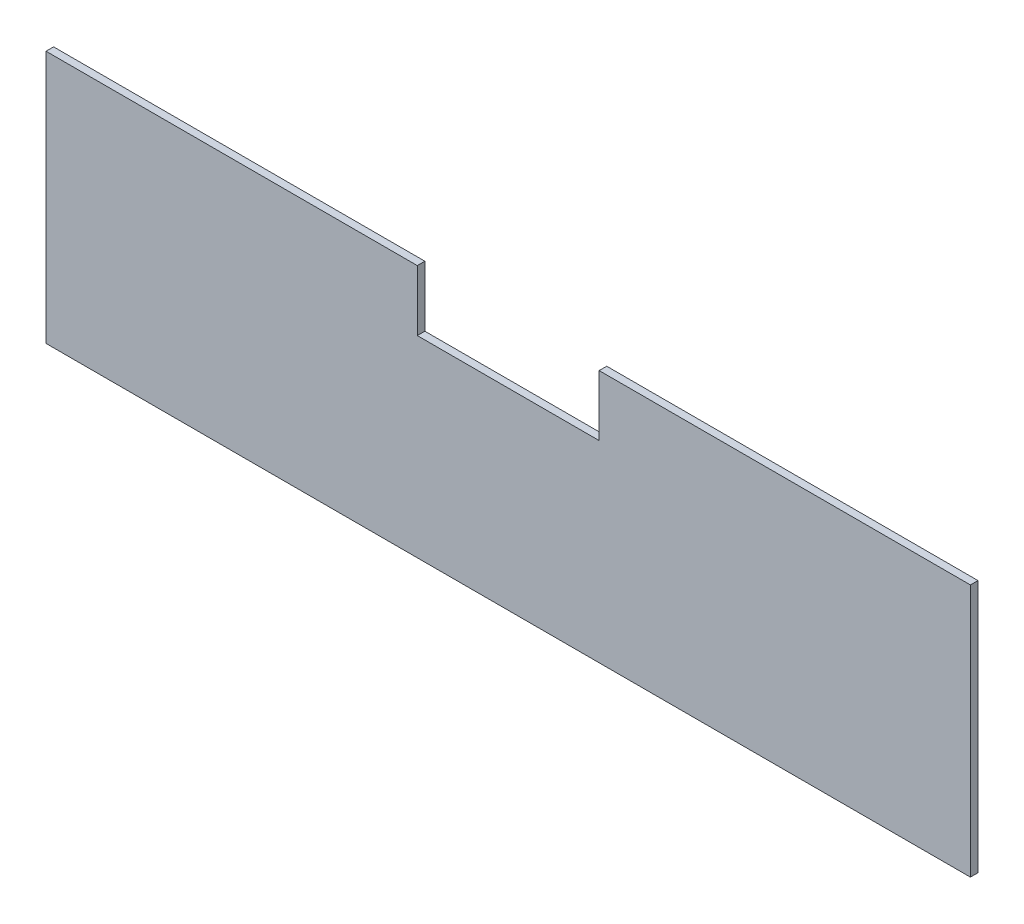
ISO-10303-21;
HEADER;
FILE_DESCRIPTION(('STEP AP214'),'2;1');
FILE_NAME('part.step','',(''),(''),'','','');
FILE_SCHEMA(('AUTOMOTIVE_DESIGN { 1 0 10303 214 1 1 1 1 }'));
ENDSEC;
DATA;
#1=APPLICATION_CONTEXT('core data for automotive mechanical design processes');
#2=APPLICATION_PROTOCOL_DEFINITION('international standard','automotive_design',2000,#1);
#3=PRODUCT_CONTEXT('',#1,'mechanical');
#4=PRODUCT('Part','Part','',(#3));
#5=PRODUCT_RELATED_PRODUCT_CATEGORY('part','',(#4));
#6=PRODUCT_DEFINITION_FORMATION('','',#4);
#7=PRODUCT_DEFINITION_CONTEXT('part definition',#1,'design');
#8=PRODUCT_DEFINITION('design','',#6,#7);
#9=PRODUCT_DEFINITION_SHAPE('','',#8);
#10=(LENGTH_UNIT() NAMED_UNIT(*) SI_UNIT(.MILLI.,.METRE.));
#11=(NAMED_UNIT(*) PLANE_ANGLE_UNIT() SI_UNIT($,.RADIAN.));
#12=(NAMED_UNIT(*) SI_UNIT($,.STERADIAN.) SOLID_ANGLE_UNIT());
#13=UNCERTAINTY_MEASURE_WITH_UNIT(LENGTH_MEASURE(1.E-05),#10,'distance_accuracy_value','');
#14=(GEOMETRIC_REPRESENTATION_CONTEXT(3) GLOBAL_UNCERTAINTY_ASSIGNED_CONTEXT((#13)) GLOBAL_UNIT_ASSIGNED_CONTEXT((#10,
#11,#12)) REPRESENTATION_CONTEXT('',''));
#15=CARTESIAN_POINT('',(0.,0.,0.));
#16=DIRECTION('',(0.,0.,1.));
#17=DIRECTION('',(1.,0.,0.));
#18=AXIS2_PLACEMENT_3D('',#15,#16,#17);
#19=CARTESIAN_POINT('',(-193.675,53.0225,3.175));
#20=DIRECTION('',(1.,0.,0.));
#21=DIRECTION('',(0.,0.,-1.));
#22=AXIS2_PLACEMENT_3D('',#19,#20,#21);
#23=PLANE('',#22);
#24=DIRECTION('',(0.,-1.,0.));
#25=VECTOR('',#24,1.);
#26=CARTESIAN_POINT('',(-193.675,53.0225,0.));
#27=LINE('',#26,#25);
#28=CARTESIAN_POINT('',(-193.675,53.0225,0.));
#29=VERTEX_POINT('',#28);
#30=CARTESIAN_POINT('',(-193.675,-53.0225,0.));
#31=VERTEX_POINT('',#30);
#32=EDGE_CURVE('E129',#29,#31,#27,.T.);
#33=ORIENTED_EDGE('',*,*,#32,.T.);
#34=DIRECTION('',(0.,0.,-1.));
#35=VECTOR('',#34,1.);
#36=CARTESIAN_POINT('',(-193.675,-53.0225,3.175));
#37=LINE('',#36,#35);
#38=CARTESIAN_POINT('',(-193.675,-53.0225,3.175));
#39=VERTEX_POINT('',#38);
#40=EDGE_CURVE('E11',#39,#31,#37,.T.);
#41=ORIENTED_EDGE('',*,*,#40,.F.);
#42=DIRECTION('',(0.,-1.,0.));
#43=VECTOR('',#42,1.);
#44=CARTESIAN_POINT('',(-193.675,53.0225,3.175));
#45=LINE('',#44,#43);
#46=CARTESIAN_POINT('',(-193.675,53.0225,3.175));
#47=VERTEX_POINT('',#46);
#48=EDGE_CURVE('E143',#47,#39,#45,.T.);
#49=ORIENTED_EDGE('',*,*,#48,.F.);
#50=DIRECTION('',(0.,0.,-1.));
#51=VECTOR('',#50,1.);
#52=CARTESIAN_POINT('',(-193.675,53.0225,3.175));
#53=LINE('',#52,#51);
#54=EDGE_CURVE('E125',#47,#29,#53,.T.);
#55=ORIENTED_EDGE('',*,*,#54,.T.);
#56=EDGE_LOOP('',(#33,#41,#49,#55));
#57=FACE_BOUND('',#56,.T.);
#58=ADVANCED_FACE('F33',(#57),#23,.F.);
#59=CARTESIAN_POINT('',(-193.675,-53.0225,3.175));
#60=DIRECTION('',(0.,1.,0.));
#61=DIRECTION('',(-1.,0.,0.));
#62=AXIS2_PLACEMENT_3D('',#59,#60,#61);
#63=PLANE('',#62);
#64=DIRECTION('',(1.,0.,0.));
#65=VECTOR('',#64,1.);
#66=CARTESIAN_POINT('',(-193.675,-53.0225,0.));
#67=LINE('',#66,#65);
#68=CARTESIAN_POINT('',(193.675,-53.0225,0.));
#69=VERTEX_POINT('',#68);
#70=EDGE_CURVE('E132',#31,#69,#67,.T.);
#71=ORIENTED_EDGE('',*,*,#70,.T.);
#72=DIRECTION('',(0.,0.,-1.));
#73=VECTOR('',#72,1.);
#74=CARTESIAN_POINT('',(193.675,-53.0225,3.175));
#75=LINE('',#74,#73);
#76=CARTESIAN_POINT('',(193.675,-53.0225,3.175));
#77=VERTEX_POINT('',#76);
#78=EDGE_CURVE('E41',#77,#69,#75,.T.);
#79=ORIENTED_EDGE('',*,*,#78,.F.);
#80=DIRECTION('',(1.,0.,0.));
#81=VECTOR('',#80,1.);
#82=CARTESIAN_POINT('',(-193.675,-53.0225,3.175));
#83=LINE('',#82,#81);
#84=EDGE_CURVE('E92',#39,#77,#83,.T.);
#85=ORIENTED_EDGE('',*,*,#84,.F.);
#86=ORIENTED_EDGE('',*,*,#40,.T.);
#87=EDGE_LOOP('',(#71,#79,#85,#86));
#88=FACE_BOUND('',#87,.T.);
#89=ADVANCED_FACE('F178',(#88),#63,.F.);
#90=CARTESIAN_POINT('',(193.675,53.0225,3.175));
#91=DIRECTION('',(-1.,0.,0.));
#92=DIRECTION('',(0.,0.,1.));
#93=AXIS2_PLACEMENT_3D('',#90,#91,#92);
#94=PLANE('',#93);
#95=DIRECTION('',(0.,1.,0.));
#96=VECTOR('',#95,1.);
#97=CARTESIAN_POINT('',(193.675,53.0225,0.));
#98=LINE('',#97,#96);
#99=CARTESIAN_POINT('',(193.675,53.0225,0.));
#100=VERTEX_POINT('',#99);
#101=EDGE_CURVE('E134',#69,#100,#98,.T.);
#102=ORIENTED_EDGE('',*,*,#101,.T.);
#103=DIRECTION('',(0.,0.,-1.));
#104=VECTOR('',#103,1.);
#105=CARTESIAN_POINT('',(193.675,53.0225,3.175));
#106=LINE('',#105,#104);
#107=CARTESIAN_POINT('',(193.675,53.0225,3.175));
#108=VERTEX_POINT('',#107);
#109=EDGE_CURVE('E150',#108,#100,#106,.T.);
#110=ORIENTED_EDGE('',*,*,#109,.F.);
#111=DIRECTION('',(0.,1.,0.));
#112=VECTOR('',#111,1.);
#113=CARTESIAN_POINT('',(193.675,53.0225,3.175));
#114=LINE('',#113,#112);
#115=EDGE_CURVE('E158',#77,#108,#114,.T.);
#116=ORIENTED_EDGE('',*,*,#115,.F.);
#117=ORIENTED_EDGE('',*,*,#78,.T.);
#118=EDGE_LOOP('',(#102,#110,#116,#117));
#119=FACE_BOUND('',#118,.T.);
#120=ADVANCED_FACE('F156',(#119),#94,.F.);
#121=CARTESIAN_POINT('',(38.1,53.0225,3.175));
#122=DIRECTION('',(0.,-1.,0.));
#123=DIRECTION('',(1.,0.,0.));
#124=AXIS2_PLACEMENT_3D('',#121,#122,#123);
#125=PLANE('',#124);
#126=DIRECTION('',(-1.,0.,0.));
#127=VECTOR('',#126,1.);
#128=CARTESIAN_POINT('',(38.1,53.0225,0.));
#129=LINE('',#128,#127);
#130=CARTESIAN_POINT('',(38.1,53.0225,0.));
#131=VERTEX_POINT('',#130);
#132=EDGE_CURVE('E136',#100,#131,#129,.T.);
#133=ORIENTED_EDGE('',*,*,#132,.T.);
#134=DIRECTION('',(0.,0.,-1.));
#135=VECTOR('',#134,1.);
#136=CARTESIAN_POINT('',(38.1,53.0225,3.175));
#137=LINE('',#136,#135);
#138=CARTESIAN_POINT('',(38.1,53.0225,3.175));
#139=VERTEX_POINT('',#138);
#140=EDGE_CURVE('E147',#139,#131,#137,.T.);
#141=ORIENTED_EDGE('',*,*,#140,.F.);
#142=DIRECTION('',(-1.,0.,0.));
#143=VECTOR('',#142,1.);
#144=CARTESIAN_POINT('',(38.1,53.0225,3.175));
#145=LINE('',#144,#143);
#146=EDGE_CURVE('E170',#108,#139,#145,.T.);
#147=ORIENTED_EDGE('',*,*,#146,.F.);
#148=ORIENTED_EDGE('',*,*,#109,.T.);
#149=EDGE_LOOP('',(#133,#141,#147,#148));
#150=FACE_BOUND('',#149,.T.);
#151=ADVANCED_FACE('F166',(#150),#125,.F.);
#152=CARTESIAN_POINT('',(38.1,53.0225,3.175));
#153=DIRECTION('',(1.,0.,0.));
#154=DIRECTION('',(0.,0.,-1.));
#155=AXIS2_PLACEMENT_3D('',#152,#153,#154);
#156=PLANE('',#155);
#157=DIRECTION('',(0.,-1.,0.));
#158=VECTOR('',#157,1.);
#159=CARTESIAN_POINT('',(38.1,53.0225,0.));
#160=LINE('',#159,#158);
#161=CARTESIAN_POINT('',(38.1,27.6225,0.));
#162=VERTEX_POINT('',#161);
#163=EDGE_CURVE('E138',#131,#162,#160,.T.);
#164=ORIENTED_EDGE('',*,*,#163,.T.);
#165=DIRECTION('',(0.,0.,-1.));
#166=VECTOR('',#165,1.);
#167=CARTESIAN_POINT('',(38.1,27.6225,3.175));
#168=LINE('',#167,#166);
#169=CARTESIAN_POINT('',(38.1,27.6225,3.175));
#170=VERTEX_POINT('',#169);
#171=EDGE_CURVE('E120',#170,#162,#168,.T.);
#172=ORIENTED_EDGE('',*,*,#171,.F.);
#173=DIRECTION('',(0.,-1.,0.));
#174=VECTOR('',#173,1.);
#175=CARTESIAN_POINT('',(38.1,53.0225,3.175));
#176=LINE('',#175,#174);
#177=EDGE_CURVE('E111',#139,#170,#176,.T.);
#178=ORIENTED_EDGE('',*,*,#177,.F.);
#179=ORIENTED_EDGE('',*,*,#140,.T.);
#180=EDGE_LOOP('',(#164,#172,#178,#179));
#181=FACE_BOUND('',#180,.T.);
#182=ADVANCED_FACE('F169',(#181),#156,.F.);
#183=CARTESIAN_POINT('',(-38.1,27.6225,3.175));
#184=DIRECTION('',(0.,-1.,0.));
#185=DIRECTION('',(0.,0.,-1.));
#186=AXIS2_PLACEMENT_3D('',#183,#184,#185);
#187=PLANE('',#186);
#188=DIRECTION('',(-1.,0.,0.));
#189=VECTOR('',#188,1.);
#190=CARTESIAN_POINT('',(-38.1,27.6225,0.));
#191=LINE('',#190,#189);
#192=CARTESIAN_POINT('',(-38.1,27.6225,0.));
#193=VERTEX_POINT('',#192);
#194=EDGE_CURVE('E119',#162,#193,#191,.T.);
#195=ORIENTED_EDGE('',*,*,#194,.T.);
#196=DIRECTION('',(0.,0.,-1.));
#197=VECTOR('',#196,1.);
#198=CARTESIAN_POINT('',(-38.1,27.6225,3.175));
#199=LINE('',#198,#197);
#200=CARTESIAN_POINT('',(-38.1,27.6225,3.175));
#201=VERTEX_POINT('',#200);
#202=EDGE_CURVE('E116',#201,#193,#199,.T.);
#203=ORIENTED_EDGE('',*,*,#202,.F.);
#204=DIRECTION('',(-1.,0.,0.));
#205=VECTOR('',#204,1.);
#206=CARTESIAN_POINT('',(-38.1,27.6225,3.175));
#207=LINE('',#206,#205);
#208=EDGE_CURVE('E105',#170,#201,#207,.T.);
#209=ORIENTED_EDGE('',*,*,#208,.F.);
#210=ORIENTED_EDGE('',*,*,#171,.T.);
#211=EDGE_LOOP('',(#195,#203,#209,#210));
#212=FACE_BOUND('',#211,.T.);
#213=ADVANCED_FACE('F117',(#212),#187,.F.);
#214=CARTESIAN_POINT('',(-38.1,53.0225,3.175));
#215=DIRECTION('',(-1.,0.,0.));
#216=DIRECTION('',(0.,0.,1.));
#217=AXIS2_PLACEMENT_3D('',#214,#215,#216);
#218=PLANE('',#217);
#219=DIRECTION('',(0.,1.,0.));
#220=VECTOR('',#219,1.);
#221=CARTESIAN_POINT('',(-38.1,53.0225,0.));
#222=LINE('',#221,#220);
#223=CARTESIAN_POINT('',(-38.1,53.0225,0.));
#224=VERTEX_POINT('',#223);
#225=EDGE_CURVE('E78',#193,#224,#222,.T.);
#226=ORIENTED_EDGE('',*,*,#225,.T.);
#227=DIRECTION('',(0.,0.,-1.));
#228=VECTOR('',#227,1.);
#229=CARTESIAN_POINT('',(-38.1,53.0225,3.175));
#230=LINE('',#229,#228);
#231=CARTESIAN_POINT('',(-38.1,53.0225,3.175));
#232=VERTEX_POINT('',#231);
#233=EDGE_CURVE('E121',#232,#224,#230,.T.);
#234=ORIENTED_EDGE('',*,*,#233,.F.);
#235=DIRECTION('',(0.,1.,0.));
#236=VECTOR('',#235,1.);
#237=CARTESIAN_POINT('',(-38.1,53.0225,3.175));
#238=LINE('',#237,#236);
#239=EDGE_CURVE('E109',#201,#232,#238,.T.);
#240=ORIENTED_EDGE('',*,*,#239,.F.);
#241=ORIENTED_EDGE('',*,*,#202,.T.);
#242=EDGE_LOOP('',(#226,#234,#240,#241));
#243=FACE_BOUND('',#242,.T.);
#244=ADVANCED_FACE('F123',(#243),#218,.F.);
#245=CARTESIAN_POINT('',(-193.675,53.0225,3.175));
#246=DIRECTION('',(0.,-1.,0.));
#247=DIRECTION('',(1.,0.,0.));
#248=AXIS2_PLACEMENT_3D('',#245,#246,#247);
#249=PLANE('',#248);
#250=DIRECTION('',(-1.,0.,0.));
#251=VECTOR('',#250,1.);
#252=CARTESIAN_POINT('',(-193.675,53.0225,0.));
#253=LINE('',#252,#251);
#254=EDGE_CURVE('E84',#224,#29,#253,.T.);
#255=ORIENTED_EDGE('',*,*,#254,.T.);
#256=ORIENTED_EDGE('',*,*,#54,.F.);
#257=DIRECTION('',(-1.,0.,0.));
#258=VECTOR('',#257,1.);
#259=CARTESIAN_POINT('',(-193.675,53.0225,3.175));
#260=LINE('',#259,#258);
#261=EDGE_CURVE('E49',#232,#47,#260,.T.);
#262=ORIENTED_EDGE('',*,*,#261,.F.);
#263=ORIENTED_EDGE('',*,*,#233,.T.);
#264=EDGE_LOOP('',(#255,#256,#262,#263));
#265=FACE_BOUND('',#264,.T.);
#266=ADVANCED_FACE('F194',(#265),#249,.F.);
#267=CARTESIAN_POINT('',(0.,0.,3.175));
#268=DIRECTION('',(0.,0.,1.));
#269=DIRECTION('',(1.,0.,0.));
#270=AXIS2_PLACEMENT_3D('',#267,#268,#269);
#271=PLANE('',#270);
#272=ORIENTED_EDGE('',*,*,#48,.T.);
#273=ORIENTED_EDGE('',*,*,#84,.T.);
#274=ORIENTED_EDGE('',*,*,#115,.T.);
#275=ORIENTED_EDGE('',*,*,#146,.T.);
#276=ORIENTED_EDGE('',*,*,#177,.T.);
#277=ORIENTED_EDGE('',*,*,#208,.T.);
#278=ORIENTED_EDGE('',*,*,#239,.T.);
#279=ORIENTED_EDGE('',*,*,#261,.T.);
#280=EDGE_LOOP('',(#272,#273,#274,#275,#276,#277,#278,#279));
#281=FACE_BOUND('',#280,.T.);
#282=ADVANCED_FACE('F107',(#281),#271,.T.);
#283=CARTESIAN_POINT('',(0.,0.,0.));
#284=DIRECTION('',(0.,0.,1.));
#285=DIRECTION('',(1.,0.,0.));
#286=AXIS2_PLACEMENT_3D('',#283,#284,#285);
#287=PLANE('',#286);
#288=ORIENTED_EDGE('',*,*,#32,.F.);
#289=ORIENTED_EDGE('',*,*,#254,.F.);
#290=ORIENTED_EDGE('',*,*,#225,.F.);
#291=ORIENTED_EDGE('',*,*,#194,.F.);
#292=ORIENTED_EDGE('',*,*,#163,.F.);
#293=ORIENTED_EDGE('',*,*,#132,.F.);
#294=ORIENTED_EDGE('',*,*,#101,.F.);
#295=ORIENTED_EDGE('',*,*,#70,.F.);
#296=EDGE_LOOP('',(#288,#289,#290,#291,#292,#293,#294,#295));
#297=FACE_BOUND('',#296,.T.);
#298=ADVANCED_FACE('F162',(#297),#287,.F.);
#299=CLOSED_SHELL('',(#58,#89,#120,#151,#182,#213,#244,#266,#282,#298));
#300=MANIFOLD_SOLID_BREP('B2',#299);
#301=ADVANCED_BREP_SHAPE_REPRESENTATION('',(#18,#300),#14);
#302=SHAPE_DEFINITION_REPRESENTATION(#9,#301);
ENDSEC;
END-ISO-10303-21;
